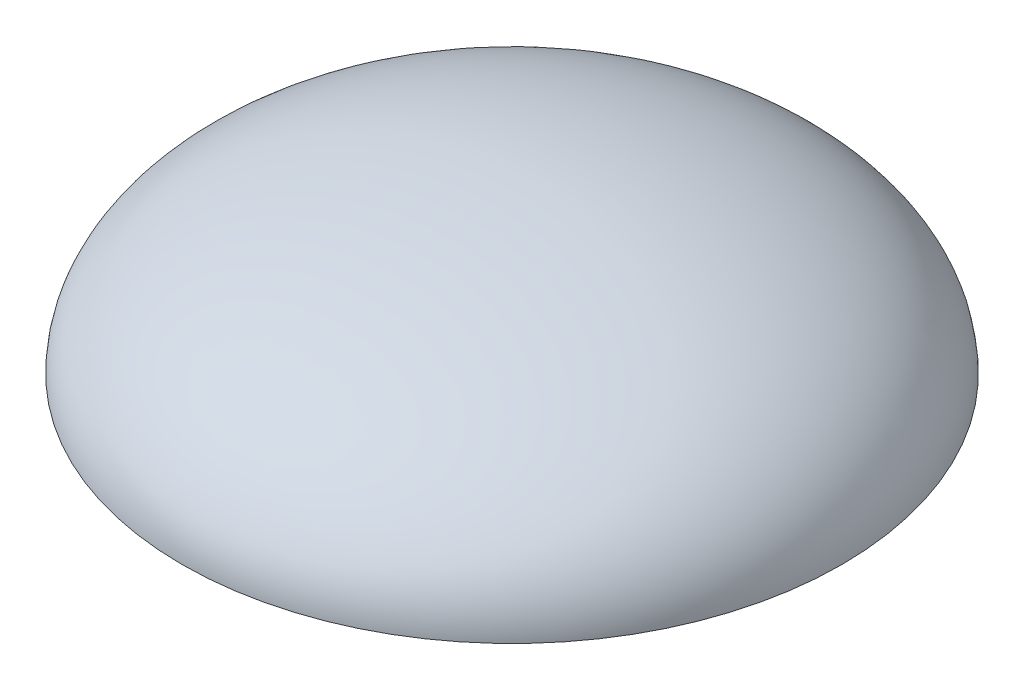
ISO-10303-21;
HEADER;
FILE_DESCRIPTION(('STEP AP214'),'2;1');
FILE_NAME('part.step','',(''),(''),'','','');
FILE_SCHEMA(('AUTOMOTIVE_DESIGN { 1 0 10303 214 1 1 1 1 }'));
ENDSEC;
DATA;
#1=APPLICATION_CONTEXT('core data for automotive mechanical design processes');
#2=APPLICATION_PROTOCOL_DEFINITION('international standard','automotive_design',2000,#1);
#3=PRODUCT_CONTEXT('',#1,'mechanical');
#4=PRODUCT('Part','Part','',(#3));
#5=PRODUCT_RELATED_PRODUCT_CATEGORY('part','',(#4));
#6=PRODUCT_DEFINITION_FORMATION('','',#4);
#7=PRODUCT_DEFINITION_CONTEXT('part definition',#1,'design');
#8=PRODUCT_DEFINITION('design','',#6,#7);
#9=PRODUCT_DEFINITION_SHAPE('','',#8);
#10=(LENGTH_UNIT() NAMED_UNIT(*) SI_UNIT(.MILLI.,.METRE.));
#11=(NAMED_UNIT(*) PLANE_ANGLE_UNIT() SI_UNIT($,.RADIAN.));
#12=(NAMED_UNIT(*) SI_UNIT($,.STERADIAN.) SOLID_ANGLE_UNIT());
#13=UNCERTAINTY_MEASURE_WITH_UNIT(LENGTH_MEASURE(1.E-05),#10,'distance_accuracy_value','');
#14=(GEOMETRIC_REPRESENTATION_CONTEXT(3) GLOBAL_UNCERTAINTY_ASSIGNED_CONTEXT((#13)) GLOBAL_UNIT_ASSIGNED_CONTEXT((#10,
#11,#12)) REPRESENTATION_CONTEXT('',''));
#15=CARTESIAN_POINT('',(0.,0.,0.));
#16=DIRECTION('',(0.,0.,1.));
#17=DIRECTION('',(1.,0.,0.));
#18=AXIS2_PLACEMENT_3D('',#15,#16,#17);
#19=CARTESIAN_POINT('',(-13.25,0.,0.));
#20=DIRECTION('',(0.,-1.,0.));
#21=DIRECTION('',(0.,0.,-1.));
#22=AXIS2_PLACEMENT_3D('',#19,#20,#21);
#23=PLANE('',#22);
#24=CARTESIAN_POINT('',(0.,0.,0.));
#25=DIRECTION('',(0.,1.,0.));
#26=DIRECTION('',(0.,0.,1.));
#27=AXIS2_PLACEMENT_3D('',#24,#25,#26);
#28=CIRCLE('',#27,13.25);
#29=CARTESIAN_POINT('',(0.,0.,13.25));
#30=VERTEX_POINT('',#29);
#31=EDGE_CURVE('E11',#30,#30,#28,.T.);
#32=ORIENTED_EDGE('',*,*,#31,.F.);
#33=EDGE_LOOP('',(#32));
#34=FACE_BOUND('',#33,.T.);
#35=CARTESIAN_POINT('',(0.,0.,0.));
#36=DIRECTION('',(0.,1.,0.));
#37=DIRECTION('',(0.,0.,1.));
#38=AXIS2_PLACEMENT_3D('',#35,#36,#37);
#39=CIRCLE('',#38,10.25);
#40=CARTESIAN_POINT('',(0.,0.,10.25));
#41=VERTEX_POINT('',#40);
#42=EDGE_CURVE('E40',#41,#41,#39,.T.);
#43=ORIENTED_EDGE('',*,*,#42,.T.);
#44=EDGE_LOOP('',(#43));
#45=FACE_BOUND('',#44,.T.);
#46=ADVANCED_FACE('F32',(#34,#45),#23,.T.);
#47=CARTESIAN_POINT('',(0.,0.,0.));
#48=DIRECTION('',(0.,0.,1.));
#49=DIRECTION('',(1.,0.,0.));
#50=AXIS2_PLACEMENT_3D('',#47,#48,#49);
#51=ELLIPSE('',#50,13.25,6.5);
#52=TRIMMED_CURVE('',#51,(PARAMETER_VALUE(1.5707963267949)),(PARAMETER_VALUE(4.71238898038469)),
.T.,.PARAMETER.);
#53=CARTESIAN_POINT('',(0.,6.5,0.));
#54=DIRECTION('',(0.,1.,0.));
#55=AXIS1_PLACEMENT('',#53,#54);
#56=SURFACE_OF_REVOLUTION('',#52,#55);
#57=ORIENTED_EDGE('',*,*,#31,.T.);
#58=EDGE_LOOP('',(#57));
#59=FACE_BOUND('',#58,.T.);
#60=CARTESIAN_POINT('',(0.,6.5,0.));
#61=VERTEX_POINT('',#60);
#62=VERTEX_LOOP('',#61);
#63=FACE_BOUND('',#62,.T.);
#64=ADVANCED_FACE('F34',(#59,#63),#56,.F.);
#65=CARTESIAN_POINT('',(0.,0.,0.));
#66=DIRECTION('',(0.,0.,1.));
#67=DIRECTION('',(1.,0.,0.));
#68=AXIS2_PLACEMENT_3D('',#65,#66,#67);
#69=ELLIPSE('',#68,13.25,6.5);
#70=TRIMMED_CURVE('',#69,(PARAMETER_VALUE(1.5707963267949)),(PARAMETER_VALUE(4.71238898038469)),
.T.,.PARAMETER.);
#71=CARTESIAN_POINT('',(0.,6.5,0.));
#72=DIRECTION('',(0.,1.,0.));
#73=AXIS1_PLACEMENT('',#71,#72);
#74=SURFACE_OF_REVOLUTION('',#70,#73);
#75=OFFSET_SURFACE('',#74,3.,.F.);
#76=ORIENTED_EDGE('',*,*,#42,.F.);
#77=EDGE_LOOP('',(#76));
#78=FACE_BOUND('',#77,.T.);
#79=CARTESIAN_POINT('',(0.,3.5,0.));
#80=VERTEX_POINT('',#79);
#81=VERTEX_LOOP('',#80);
#82=FACE_BOUND('',#81,.T.);
#83=ADVANCED_FACE('F46',(#78,#82),#75,.T.);
#84=CLOSED_SHELL('',(#46,#64,#83));
#85=MANIFOLD_SOLID_BREP('B2',#84);
#86=ADVANCED_BREP_SHAPE_REPRESENTATION('',(#18,#85),#14);
#87=SHAPE_DEFINITION_REPRESENTATION(#9,#86);
ENDSEC;
END-ISO-10303-21;
